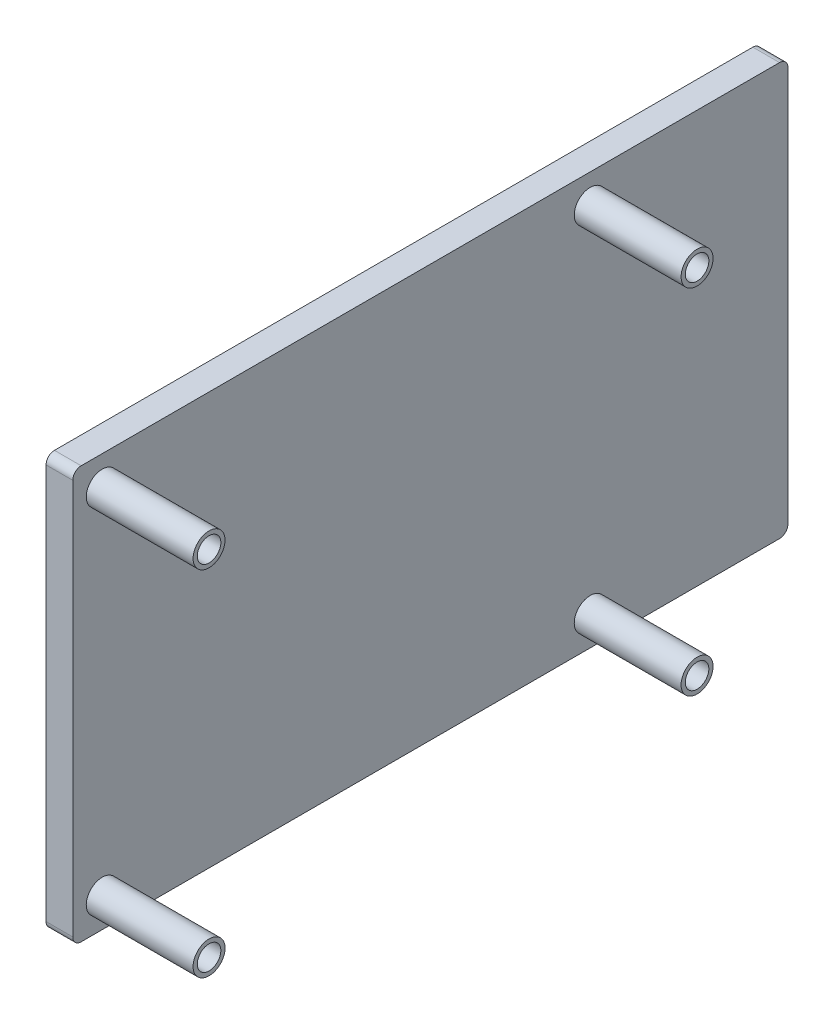
ISO-10303-21;
HEADER;
FILE_DESCRIPTION(('STEP AP214'),'2;1');
FILE_NAME('part.step','',(''),(''),'','','');
FILE_SCHEMA(('AUTOMOTIVE_DESIGN { 1 0 10303 214 1 1 1 1 }'));
ENDSEC;
DATA;
#1=APPLICATION_CONTEXT('core data for automotive mechanical design processes');
#2=APPLICATION_PROTOCOL_DEFINITION('international standard','automotive_design',2000,#1);
#3=PRODUCT_CONTEXT('',#1,'mechanical');
#4=PRODUCT('Part','Part','',(#3));
#5=PRODUCT_RELATED_PRODUCT_CATEGORY('part','',(#4));
#6=PRODUCT_DEFINITION_FORMATION('','',#4);
#7=PRODUCT_DEFINITION_CONTEXT('part definition',#1,'design');
#8=PRODUCT_DEFINITION('design','',#6,#7);
#9=PRODUCT_DEFINITION_SHAPE('','',#8);
#10=(LENGTH_UNIT() NAMED_UNIT(*) SI_UNIT(.MILLI.,.METRE.));
#11=(NAMED_UNIT(*) PLANE_ANGLE_UNIT() SI_UNIT($,.RADIAN.));
#12=(NAMED_UNIT(*) SI_UNIT($,.STERADIAN.) SOLID_ANGLE_UNIT());
#13=UNCERTAINTY_MEASURE_WITH_UNIT(LENGTH_MEASURE(1.E-05),#10,'distance_accuracy_value','');
#14=(GEOMETRIC_REPRESENTATION_CONTEXT(3) GLOBAL_UNCERTAINTY_ASSIGNED_CONTEXT((#13)) GLOBAL_UNIT_ASSIGNED_CONTEXT((#10,
#11,#12)) REPRESENTATION_CONTEXT('',''));
#15=CARTESIAN_POINT('',(0.,0.,0.));
#16=DIRECTION('',(0.,0.,1.));
#17=DIRECTION('',(1.,0.,0.));
#18=AXIS2_PLACEMENT_3D('',#15,#16,#17);
#19=CARTESIAN_POINT('',(3.175,15.3017543859649,54.3298245614035));
#20=DIRECTION('',(0.,0.,-1.));
#21=DIRECTION('',(-1.,0.,0.));
#22=AXIS2_PLACEMENT_3D('',#19,#20,#21);
#23=PLANE('',#22);
#24=DIRECTION('',(0.,-1.,0.));
#25=VECTOR('',#24,1.);
#26=CARTESIAN_POINT('',(3.175,15.3017543859649,54.3298245614035));
#27=LINE('',#26,#25);
#28=CARTESIAN_POINT('',(3.175,14.3017543859649,54.3298245614035));
#29=VERTEX_POINT('',#28);
#30=CARTESIAN_POINT('',(3.175,-32.6982456140351,54.3298245614035));
#31=VERTEX_POINT('',#30);
#32=EDGE_CURVE('E119',#29,#31,#27,.T.);
#33=ORIENTED_EDGE('',*,*,#32,.F.);
#34=DIRECTION('',(-1.,0.,0.));
#35=VECTOR('',#34,1.);
#36=CARTESIAN_POINT('',(3.175,14.3017543859649,54.3298245614035));
#37=LINE('',#36,#35);
#38=CARTESIAN_POINT('',(0.,14.3017543859649,54.3298245614035));
#39=VERTEX_POINT('',#38);
#40=EDGE_CURVE('E104',#29,#39,#37,.T.);
#41=ORIENTED_EDGE('',*,*,#40,.T.);
#42=DIRECTION('',(0.,-1.,0.));
#43=VECTOR('',#42,1.);
#44=CARTESIAN_POINT('',(0.,15.3017543859649,54.3298245614035));
#45=LINE('',#44,#43);
#46=CARTESIAN_POINT('',(0.,-32.6982456140351,54.3298245614035));
#47=VERTEX_POINT('',#46);
#48=EDGE_CURVE('E116',#39,#47,#45,.T.);
#49=ORIENTED_EDGE('',*,*,#48,.T.);
#50=DIRECTION('',(-1.,0.,0.));
#51=VECTOR('',#50,1.);
#52=CARTESIAN_POINT('',(3.175,-32.6982456140351,54.3298245614035));
#53=LINE('',#52,#51);
#54=EDGE_CURVE('E121',#47,#31,#53,.F.);
#55=ORIENTED_EDGE('',*,*,#54,.T.);
#56=EDGE_LOOP('',(#33,#41,#49,#55));
#57=FACE_BOUND('',#56,.T.);
#58=ADVANCED_FACE('F34',(#57),#23,.F.);
#59=CARTESIAN_POINT('',(3.175,-33.6982456140351,54.3298245614035));
#60=DIRECTION('',(0.,1.,0.));
#61=DIRECTION('',(0.,0.,1.));
#62=AXIS2_PLACEMENT_3D('',#59,#60,#61);
#63=PLANE('',#62);
#64=DIRECTION('',(0.,0.,-1.));
#65=VECTOR('',#64,1.);
#66=CARTESIAN_POINT('',(0.,-33.6982456140351,54.3298245614035));
#67=LINE('',#66,#65);
#68=CARTESIAN_POINT('',(0.,-33.6982456140351,53.3298245614035));
#69=VERTEX_POINT('',#68);
#70=CARTESIAN_POINT('',(0.,-33.6982456140351,-29.6701754385965));
#71=VERTEX_POINT('',#70);
#72=EDGE_CURVE('E125',#69,#71,#67,.T.);
#73=ORIENTED_EDGE('',*,*,#72,.T.);
#74=DIRECTION('',(-1.,0.,0.));
#75=VECTOR('',#74,1.);
#76=CARTESIAN_POINT('',(3.175,-33.6982456140351,-29.6701754385965));
#77=LINE('',#76,#75);
#78=CARTESIAN_POINT('',(3.175,-33.6982456140351,-29.6701754385965));
#79=VERTEX_POINT('',#78);
#80=EDGE_CURVE('E11',#71,#79,#77,.F.);
#81=ORIENTED_EDGE('',*,*,#80,.T.);
#82=DIRECTION('',(0.,0.,-1.));
#83=VECTOR('',#82,1.);
#84=CARTESIAN_POINT('',(3.175,-33.6982456140351,54.3298245614035));
#85=LINE('',#84,#83);
#86=CARTESIAN_POINT('',(3.175,-33.6982456140351,53.3298245614035));
#87=VERTEX_POINT('',#86);
#88=EDGE_CURVE('E177',#87,#79,#85,.T.);
#89=ORIENTED_EDGE('',*,*,#88,.F.);
#90=DIRECTION('',(-1.,0.,0.));
#91=VECTOR('',#90,1.);
#92=CARTESIAN_POINT('',(3.175,-33.6982456140351,53.3298245614035));
#93=LINE('',#92,#91);
#94=EDGE_CURVE('E42',#87,#69,#93,.T.);
#95=ORIENTED_EDGE('',*,*,#94,.T.);
#96=EDGE_LOOP('',(#73,#81,#89,#95));
#97=FACE_BOUND('',#96,.T.);
#98=ADVANCED_FACE('F175',(#97),#63,.F.);
#99=CARTESIAN_POINT('',(3.175,15.3017543859649,-30.6701754385965));
#100=DIRECTION('',(0.,0.,1.));
#101=DIRECTION('',(1.,0.,0.));
#102=AXIS2_PLACEMENT_3D('',#99,#100,#101);
#103=PLANE('',#102);
#104=DIRECTION('',(0.,1.,0.));
#105=VECTOR('',#104,1.);
#106=CARTESIAN_POINT('',(0.,15.3017543859649,-30.6701754385965));
#107=LINE('',#106,#105);
#108=CARTESIAN_POINT('',(0.,-32.6982456140351,-30.6701754385965));
#109=VERTEX_POINT('',#108);
#110=CARTESIAN_POINT('',(0.,14.3017543859649,-30.6701754385965));
#111=VERTEX_POINT('',#110);
#112=EDGE_CURVE('E129',#109,#111,#107,.T.);
#113=ORIENTED_EDGE('',*,*,#112,.T.);
#114=DIRECTION('',(-1.,0.,0.));
#115=VECTOR('',#114,1.);
#116=CARTESIAN_POINT('',(3.175,14.3017543859649,-30.6701754385965));
#117=LINE('',#116,#115);
#118=CARTESIAN_POINT('',(3.175,14.3017543859649,-30.6701754385965));
#119=VERTEX_POINT('',#118);
#120=EDGE_CURVE('E49',#111,#119,#117,.F.);
#121=ORIENTED_EDGE('',*,*,#120,.T.);
#122=DIRECTION('',(0.,1.,0.));
#123=VECTOR('',#122,1.);
#124=CARTESIAN_POINT('',(3.175,15.3017543859649,-30.6701754385965));
#125=LINE('',#124,#123);
#126=CARTESIAN_POINT('',(3.175,-32.6982456140351,-30.6701754385965));
#127=VERTEX_POINT('',#126);
#128=EDGE_CURVE('E185',#127,#119,#125,.T.);
#129=ORIENTED_EDGE('',*,*,#128,.F.);
#130=DIRECTION('',(-1.,0.,0.));
#131=VECTOR('',#130,1.);
#132=CARTESIAN_POINT('',(3.175,-32.6982456140351,-30.6701754385965));
#133=LINE('',#132,#131);
#134=EDGE_CURVE('E168',#127,#109,#133,.T.);
#135=ORIENTED_EDGE('',*,*,#134,.T.);
#136=EDGE_LOOP('',(#113,#121,#129,#135));
#137=FACE_BOUND('',#136,.T.);
#138=ADVANCED_FACE('F184',(#137),#103,.F.);
#139=CARTESIAN_POINT('',(3.175,15.3017543859649,54.3298245614035));
#140=DIRECTION('',(0.,-1.,0.));
#141=DIRECTION('',(0.,0.,-1.));
#142=AXIS2_PLACEMENT_3D('',#139,#140,#141);
#143=PLANE('',#142);
#144=DIRECTION('',(0.,0.,1.));
#145=VECTOR('',#144,1.);
#146=CARTESIAN_POINT('',(0.,15.3017543859649,54.3298245614035));
#147=LINE('',#146,#145);
#148=CARTESIAN_POINT('',(0.,15.3017543859649,-29.6701754385965));
#149=VERTEX_POINT('',#148);
#150=CARTESIAN_POINT('',(0.,15.3017543859649,53.3298245614035));
#151=VERTEX_POINT('',#150);
#152=EDGE_CURVE('E139',#149,#151,#147,.T.);
#153=ORIENTED_EDGE('',*,*,#152,.T.);
#154=DIRECTION('',(-1.,0.,0.));
#155=VECTOR('',#154,1.);
#156=CARTESIAN_POINT('',(3.175,15.3017543859649,53.3298245614035));
#157=LINE('',#156,#155);
#158=CARTESIAN_POINT('',(3.175,15.3017543859649,53.3298245614035));
#159=VERTEX_POINT('',#158);
#160=EDGE_CURVE('E105',#151,#159,#157,.F.);
#161=ORIENTED_EDGE('',*,*,#160,.T.);
#162=DIRECTION('',(0.,0.,1.));
#163=VECTOR('',#162,1.);
#164=CARTESIAN_POINT('',(3.175,15.3017543859649,54.3298245614035));
#165=LINE('',#164,#163);
#166=CARTESIAN_POINT('',(3.175,15.3017543859649,-29.6701754385965));
#167=VERTEX_POINT('',#166);
#168=EDGE_CURVE('E135',#167,#159,#165,.T.);
#169=ORIENTED_EDGE('',*,*,#168,.F.);
#170=DIRECTION('',(-1.,0.,0.));
#171=VECTOR('',#170,1.);
#172=CARTESIAN_POINT('',(3.175,15.3017543859649,-29.6701754385965));
#173=LINE('',#172,#171);
#174=EDGE_CURVE('E110',#167,#149,#173,.T.);
#175=ORIENTED_EDGE('',*,*,#174,.T.);
#176=EDGE_LOOP('',(#153,#161,#169,#175));
#177=FACE_BOUND('',#176,.T.);
#178=ADVANCED_FACE('F268',(#177),#143,.F.);
#179=CARTESIAN_POINT('',(3.175,0.,0.));
#180=DIRECTION('',(1.,0.,0.));
#181=DIRECTION('',(0.,0.,-1.));
#182=AXIS2_PLACEMENT_3D('',#179,#180,#181);
#183=PLANE('',#182);
#184=CARTESIAN_POINT('',(3.175,-30.1982456140351,50.8298245614035));
#185=DIRECTION('',(1.,0.,0.));
#186=DIRECTION('',(0.,0.,1.));
#187=AXIS2_PLACEMENT_3D('',#184,#185,#186);
#188=CIRCLE('',#187,1.9);
#189=CARTESIAN_POINT('',(3.175,-30.1982456140351,52.7298245614035));
#190=VERTEX_POINT('',#189);
#191=EDGE_CURVE('E215',#190,#190,#188,.T.);
#192=ORIENTED_EDGE('',*,*,#191,.F.);
#193=EDGE_LOOP('',(#192));
#194=FACE_BOUND('',#193,.T.);
#195=CARTESIAN_POINT('',(3.175,-30.1982456140351,-7.1701754385965));
#196=DIRECTION('',(1.,0.,0.));
#197=DIRECTION('',(0.,0.,1.));
#198=AXIS2_PLACEMENT_3D('',#195,#196,#197);
#199=CIRCLE('',#198,1.9);
#200=CARTESIAN_POINT('',(3.175,-30.1982456140351,-5.2701754385965));
#201=VERTEX_POINT('',#200);
#202=EDGE_CURVE('E206',#201,#201,#199,.T.);
#203=ORIENTED_EDGE('',*,*,#202,.F.);
#204=EDGE_LOOP('',(#203));
#205=FACE_BOUND('',#204,.T.);
#206=CARTESIAN_POINT('',(3.175,11.8017543859649,-7.1701754385965));
#207=DIRECTION('',(1.,0.,0.));
#208=DIRECTION('',(0.,0.,-1.));
#209=AXIS2_PLACEMENT_3D('',#206,#207,#208);
#210=CIRCLE('',#209,1.9);
#211=CARTESIAN_POINT('',(3.175,11.8017543859649,-9.0701754385965));
#212=VERTEX_POINT('',#211);
#213=EDGE_CURVE('E197',#212,#212,#210,.T.);
#214=ORIENTED_EDGE('',*,*,#213,.F.);
#215=EDGE_LOOP('',(#214));
#216=FACE_BOUND('',#215,.T.);
#217=CARTESIAN_POINT('',(3.175,11.8017543859649,50.8298245614035));
#218=DIRECTION('',(1.,0.,0.));
#219=DIRECTION('',(0.,0.,-1.));
#220=AXIS2_PLACEMENT_3D('',#217,#218,#219);
#221=CIRCLE('',#220,1.9);
#222=CARTESIAN_POINT('',(3.175,11.8017543859649,48.9298245614035));
#223=VERTEX_POINT('',#222);
#224=EDGE_CURVE('E132',#223,#223,#221,.T.);
#225=ORIENTED_EDGE('',*,*,#224,.F.);
#226=EDGE_LOOP('',(#225));
#227=FACE_BOUND('',#226,.T.);
#228=ORIENTED_EDGE('',*,*,#168,.T.);
#229=CARTESIAN_POINT('',(3.175,14.3017543859649,53.3298245614035));
#230=DIRECTION('',(1.,0.,0.));
#231=DIRECTION('',(0.,0.,-1.));
#232=AXIS2_PLACEMENT_3D('',#229,#230,#231);
#233=CIRCLE('',#232,1.);
#234=EDGE_CURVE('E166',#159,#29,#233,.T.);
#235=ORIENTED_EDGE('',*,*,#234,.T.);
#236=ORIENTED_EDGE('',*,*,#32,.T.);
#237=CARTESIAN_POINT('',(3.175,-32.6982456140351,53.3298245614035));
#238=DIRECTION('',(1.,0.,0.));
#239=DIRECTION('',(0.,0.,-1.));
#240=AXIS2_PLACEMENT_3D('',#237,#238,#239);
#241=CIRCLE('',#240,1.);
#242=EDGE_CURVE('E161',#31,#87,#241,.T.);
#243=ORIENTED_EDGE('',*,*,#242,.T.);
#244=ORIENTED_EDGE('',*,*,#88,.T.);
#245=CARTESIAN_POINT('',(3.175,-32.6982456140351,-29.6701754385965));
#246=DIRECTION('',(1.,0.,0.));
#247=DIRECTION('',(0.,0.,-1.));
#248=AXIS2_PLACEMENT_3D('',#245,#246,#247);
#249=CIRCLE('',#248,1.);
#250=EDGE_CURVE('E56',#79,#127,#249,.T.);
#251=ORIENTED_EDGE('',*,*,#250,.T.);
#252=ORIENTED_EDGE('',*,*,#128,.T.);
#253=CARTESIAN_POINT('',(3.175,14.3017543859649,-29.6701754385965));
#254=DIRECTION('',(1.,0.,0.));
#255=DIRECTION('',(0.,0.,-1.));
#256=AXIS2_PLACEMENT_3D('',#253,#254,#255);
#257=CIRCLE('',#256,1.);
#258=EDGE_CURVE('E164',#119,#167,#257,.T.);
#259=ORIENTED_EDGE('',*,*,#258,.T.);
#260=EDGE_LOOP('',(#228,#235,#236,#243,#244,#251,#252,#259));
#261=FACE_BOUND('',#260,.T.);
#262=ADVANCED_FACE('F264',(#194,#205,#216,#227,#261),#183,.T.);
#263=CARTESIAN_POINT('',(0.,0.,0.));
#264=DIRECTION('',(1.,0.,0.));
#265=DIRECTION('',(0.,0.,-1.));
#266=AXIS2_PLACEMENT_3D('',#263,#264,#265);
#267=PLANE('',#266);
#268=ORIENTED_EDGE('',*,*,#48,.F.);
#269=CARTESIAN_POINT('',(0.,14.3017543859649,53.3298245614035));
#270=DIRECTION('',(1.,0.,0.));
#271=DIRECTION('',(0.,0.,-1.));
#272=AXIS2_PLACEMENT_3D('',#269,#270,#271);
#273=CIRCLE('',#272,1.);
#274=EDGE_CURVE('E100',#39,#151,#273,.F.);
#275=ORIENTED_EDGE('',*,*,#274,.T.);
#276=ORIENTED_EDGE('',*,*,#152,.F.);
#277=CARTESIAN_POINT('',(0.,14.3017543859649,-29.6701754385965));
#278=DIRECTION('',(1.,0.,0.));
#279=DIRECTION('',(0.,0.,-1.));
#280=AXIS2_PLACEMENT_3D('',#277,#278,#279);
#281=CIRCLE('',#280,1.);
#282=EDGE_CURVE('E111',#149,#111,#281,.F.);
#283=ORIENTED_EDGE('',*,*,#282,.T.);
#284=ORIENTED_EDGE('',*,*,#112,.F.);
#285=CARTESIAN_POINT('',(0.,-32.6982456140351,-29.6701754385965));
#286=DIRECTION('',(1.,0.,0.));
#287=DIRECTION('',(0.,0.,-1.));
#288=AXIS2_PLACEMENT_3D('',#285,#286,#287);
#289=CIRCLE('',#288,1.);
#290=EDGE_CURVE('E155',#109,#71,#289,.F.);
#291=ORIENTED_EDGE('',*,*,#290,.T.);
#292=ORIENTED_EDGE('',*,*,#72,.F.);
#293=CARTESIAN_POINT('',(0.,-32.6982456140351,53.3298245614035));
#294=DIRECTION('',(1.,0.,0.));
#295=DIRECTION('',(0.,0.,-1.));
#296=AXIS2_PLACEMENT_3D('',#293,#294,#295);
#297=CIRCLE('',#296,1.);
#298=EDGE_CURVE('E120',#69,#47,#297,.F.);
#299=ORIENTED_EDGE('',*,*,#298,.T.);
#300=EDGE_LOOP('',(#268,#275,#276,#283,#284,#291,#292,#299));
#301=FACE_BOUND('',#300,.T.);
#302=ADVANCED_FACE('F123',(#301),#267,.F.);
#303=CARTESIAN_POINT('',(15.875,11.8017543859649,50.8298245614035));
#304=DIRECTION('',(1.,0.,0.));
#305=DIRECTION('',(0.,0.,-1.));
#306=AXIS2_PLACEMENT_3D('',#303,#304,#305);
#307=PLANE('',#306);
#308=CARTESIAN_POINT('',(15.875,11.8017543859649,50.8298245614035));
#309=DIRECTION('',(1.,0.,0.));
#310=DIRECTION('',(0.,0.,-1.));
#311=AXIS2_PLACEMENT_3D('',#308,#309,#310);
#312=CIRCLE('',#311,1.9);
#313=CARTESIAN_POINT('',(15.875,11.8017543859649,48.9298245614035));
#314=VERTEX_POINT('',#313);
#315=EDGE_CURVE('E126',#314,#314,#312,.T.);
#316=ORIENTED_EDGE('',*,*,#315,.T.);
#317=EDGE_LOOP('',(#316));
#318=FACE_BOUND('',#317,.T.);
#319=CARTESIAN_POINT('',(15.875,11.8017543859649,50.8298245614035));
#320=DIRECTION('',(1.,0.,0.));
#321=DIRECTION('',(0.,0.,-1.));
#322=AXIS2_PLACEMENT_3D('',#319,#320,#321);
#323=CIRCLE('',#322,1.4);
#324=CARTESIAN_POINT('',(15.875,11.8017543859649,49.4298245614035));
#325=VERTEX_POINT('',#324);
#326=EDGE_CURVE('E192',#325,#325,#323,.T.);
#327=ORIENTED_EDGE('',*,*,#326,.F.);
#328=EDGE_LOOP('',(#327));
#329=FACE_BOUND('',#328,.T.);
#330=ADVANCED_FACE('F279',(#318,#329),#307,.T.);
#331=CARTESIAN_POINT('',(15.875,11.8017543859649,50.8298245614035));
#332=DIRECTION('',(-1.,0.,0.));
#333=DIRECTION('',(0.,0.,1.));
#334=AXIS2_PLACEMENT_3D('',#331,#332,#333);
#335=CYLINDRICAL_SURFACE('',#334,1.9);
#336=ORIENTED_EDGE('',*,*,#315,.F.);
#337=EDGE_LOOP('',(#336));
#338=FACE_BOUND('',#337,.T.);
#339=ORIENTED_EDGE('',*,*,#224,.T.);
#340=EDGE_LOOP('',(#339));
#341=FACE_BOUND('',#340,.T.);
#342=ADVANCED_FACE('F281',(#338,#341),#335,.T.);
#343=CARTESIAN_POINT('',(15.875,11.8017543859649,50.8298245614035));
#344=DIRECTION('',(-1.,0.,0.));
#345=DIRECTION('',(0.,0.,1.));
#346=AXIS2_PLACEMENT_3D('',#343,#344,#345);
#347=CYLINDRICAL_SURFACE('',#346,1.4);
#348=ORIENTED_EDGE('',*,*,#326,.T.);
#349=EDGE_LOOP('',(#348));
#350=FACE_BOUND('',#349,.T.);
#351=CARTESIAN_POINT('',(3.175,11.8017543859649,50.8298245614035));
#352=DIRECTION('',(1.,0.,0.));
#353=DIRECTION('',(0.,0.,-1.));
#354=AXIS2_PLACEMENT_3D('',#351,#352,#353);
#355=CIRCLE('',#354,1.4);
#356=CARTESIAN_POINT('',(3.175,11.8017543859649,49.4298245614035));
#357=VERTEX_POINT('',#356);
#358=EDGE_CURVE('E141',#357,#357,#355,.F.);
#359=ORIENTED_EDGE('',*,*,#358,.T.);
#360=EDGE_LOOP('',(#359));
#361=FACE_BOUND('',#360,.T.);
#362=ADVANCED_FACE('F284',(#350,#361),#347,.F.);
#363=ORIENTED_EDGE('',*,*,#358,.F.);
#364=EDGE_LOOP('',(#363));
#365=FACE_BOUND('',#364,.T.);
#366=ADVANCED_FACE('F276',(#365),#183,.T.);
#367=CARTESIAN_POINT('',(15.875,11.8017543859649,-7.1701754385965));
#368=DIRECTION('',(1.,0.,0.));
#369=DIRECTION('',(0.,0.,-1.));
#370=AXIS2_PLACEMENT_3D('',#367,#368,#369);
#371=PLANE('',#370);
#372=CARTESIAN_POINT('',(15.875,11.8017543859649,-7.1701754385965));
#373=DIRECTION('',(1.,0.,0.));
#374=DIRECTION('',(0.,0.,-1.));
#375=AXIS2_PLACEMENT_3D('',#372,#373,#374);
#376=CIRCLE('',#375,1.9);
#377=CARTESIAN_POINT('',(15.875,11.8017543859649,-9.0701754385965));
#378=VERTEX_POINT('',#377);
#379=EDGE_CURVE('E196',#378,#378,#376,.T.);
#380=ORIENTED_EDGE('',*,*,#379,.T.);
#381=EDGE_LOOP('',(#380));
#382=FACE_BOUND('',#381,.T.);
#383=CARTESIAN_POINT('',(15.875,11.8017543859649,-7.1701754385965));
#384=DIRECTION('',(1.,0.,0.));
#385=DIRECTION('',(0.,0.,-1.));
#386=AXIS2_PLACEMENT_3D('',#383,#384,#385);
#387=CIRCLE('',#386,1.4);
#388=CARTESIAN_POINT('',(15.875,11.8017543859649,-8.5701754385965));
#389=VERTEX_POINT('',#388);
#390=EDGE_CURVE('E200',#389,#389,#387,.T.);
#391=ORIENTED_EDGE('',*,*,#390,.F.);
#392=EDGE_LOOP('',(#391));
#393=FACE_BOUND('',#392,.T.);
#394=ADVANCED_FACE('F296',(#382,#393),#371,.T.);
#395=CARTESIAN_POINT('',(15.875,11.8017543859649,-7.1701754385965));
#396=DIRECTION('',(-1.,0.,0.));
#397=DIRECTION('',(0.,0.,1.));
#398=AXIS2_PLACEMENT_3D('',#395,#396,#397);
#399=CYLINDRICAL_SURFACE('',#398,1.9);
#400=ORIENTED_EDGE('',*,*,#379,.F.);
#401=EDGE_LOOP('',(#400));
#402=FACE_BOUND('',#401,.T.);
#403=ORIENTED_EDGE('',*,*,#213,.T.);
#404=EDGE_LOOP('',(#403));
#405=FACE_BOUND('',#404,.T.);
#406=ADVANCED_FACE('F292',(#402,#405),#399,.T.);
#407=CARTESIAN_POINT('',(15.875,11.8017543859649,-7.1701754385965));
#408=DIRECTION('',(-1.,0.,0.));
#409=DIRECTION('',(0.,0.,1.));
#410=AXIS2_PLACEMENT_3D('',#407,#408,#409);
#411=CYLINDRICAL_SURFACE('',#410,1.4);
#412=ORIENTED_EDGE('',*,*,#390,.T.);
#413=EDGE_LOOP('',(#412));
#414=FACE_BOUND('',#413,.T.);
#415=CARTESIAN_POINT('',(3.175,11.8017543859649,-7.1701754385965));
#416=DIRECTION('',(1.,0.,0.));
#417=DIRECTION('',(0.,0.,-1.));
#418=AXIS2_PLACEMENT_3D('',#415,#416,#417);
#419=CIRCLE('',#418,1.4);
#420=CARTESIAN_POINT('',(3.175,11.8017543859649,-8.5701754385965));
#421=VERTEX_POINT('',#420);
#422=EDGE_CURVE('E144',#421,#421,#419,.F.);
#423=ORIENTED_EDGE('',*,*,#422,.T.);
#424=EDGE_LOOP('',(#423));
#425=FACE_BOUND('',#424,.T.);
#426=ADVANCED_FACE('F295',(#414,#425),#411,.F.);
#427=ORIENTED_EDGE('',*,*,#422,.F.);
#428=EDGE_LOOP('',(#427));
#429=FACE_BOUND('',#428,.T.);
#430=ADVANCED_FACE('F242',(#429),#183,.T.);
#431=CARTESIAN_POINT('',(15.875,-30.1982456140351,-7.1701754385965));
#432=DIRECTION('',(-1.,0.,0.));
#433=DIRECTION('',(0.,0.,1.));
#434=AXIS2_PLACEMENT_3D('',#431,#432,#433);
#435=PLANE('',#434);
#436=CARTESIAN_POINT('',(15.875,-30.1982456140351,-7.1701754385965));
#437=DIRECTION('',(1.,0.,0.));
#438=DIRECTION('',(0.,0.,1.));
#439=AXIS2_PLACEMENT_3D('',#436,#437,#438);
#440=CIRCLE('',#439,1.9);
#441=CARTESIAN_POINT('',(15.875,-30.1982456140351,-5.2701754385965));
#442=VERTEX_POINT('',#441);
#443=EDGE_CURVE('E205',#442,#442,#440,.T.);
#444=ORIENTED_EDGE('',*,*,#443,.T.);
#445=EDGE_LOOP('',(#444));
#446=FACE_BOUND('',#445,.T.);
#447=CARTESIAN_POINT('',(15.875,-30.1982456140351,-7.1701754385965));
#448=DIRECTION('',(1.,0.,0.));
#449=DIRECTION('',(0.,0.,1.));
#450=AXIS2_PLACEMENT_3D('',#447,#448,#449);
#451=CIRCLE('',#450,1.4);
#452=CARTESIAN_POINT('',(15.875,-30.1982456140351,-5.7701754385965));
#453=VERTEX_POINT('',#452);
#454=EDGE_CURVE('E209',#453,#453,#451,.T.);
#455=ORIENTED_EDGE('',*,*,#454,.F.);
#456=EDGE_LOOP('',(#455));
#457=FACE_BOUND('',#456,.T.);
#458=ADVANCED_FACE('F307',(#446,#457),#435,.F.);
#459=CARTESIAN_POINT('',(15.875,-30.1982456140351,-7.1701754385965));
#460=DIRECTION('',(-1.,0.,0.));
#461=DIRECTION('',(0.,0.,1.));
#462=AXIS2_PLACEMENT_3D('',#459,#460,#461);
#463=CYLINDRICAL_SURFACE('',#462,1.9);
#464=ORIENTED_EDGE('',*,*,#443,.F.);
#465=EDGE_LOOP('',(#464));
#466=FACE_BOUND('',#465,.T.);
#467=ORIENTED_EDGE('',*,*,#202,.T.);
#468=EDGE_LOOP('',(#467));
#469=FACE_BOUND('',#468,.T.);
#470=ADVANCED_FACE('F304',(#466,#469),#463,.T.);
#471=CARTESIAN_POINT('',(15.875,-30.1982456140351,-7.1701754385965));
#472=DIRECTION('',(-1.,0.,0.));
#473=DIRECTION('',(0.,0.,1.));
#474=AXIS2_PLACEMENT_3D('',#471,#472,#473);
#475=CYLINDRICAL_SURFACE('',#474,1.4);
#476=ORIENTED_EDGE('',*,*,#454,.T.);
#477=EDGE_LOOP('',(#476));
#478=FACE_BOUND('',#477,.T.);
#479=CARTESIAN_POINT('',(3.175,-30.1982456140351,-7.1701754385965));
#480=DIRECTION('',(1.,0.,0.));
#481=DIRECTION('',(0.,0.,-1.));
#482=AXIS2_PLACEMENT_3D('',#479,#480,#481);
#483=CIRCLE('',#482,1.4);
#484=CARTESIAN_POINT('',(3.175,-30.1982456140351,-8.5701754385965));
#485=VERTEX_POINT('',#484);
#486=EDGE_CURVE('E147',#485,#485,#483,.F.);
#487=ORIENTED_EDGE('',*,*,#486,.T.);
#488=EDGE_LOOP('',(#487));
#489=FACE_BOUND('',#488,.T.);
#490=ADVANCED_FACE('F239',(#478,#489),#475,.F.);
#491=ORIENTED_EDGE('',*,*,#486,.F.);
#492=EDGE_LOOP('',(#491));
#493=FACE_BOUND('',#492,.T.);
#494=ADVANCED_FACE('F230',(#493),#183,.T.);
#495=CARTESIAN_POINT('',(15.875,-30.1982456140351,50.8298245614035));
#496=DIRECTION('',(-1.,0.,0.));
#497=DIRECTION('',(0.,0.,1.));
#498=AXIS2_PLACEMENT_3D('',#495,#496,#497);
#499=PLANE('',#498);
#500=CARTESIAN_POINT('',(15.875,-30.1982456140351,50.8298245614035));
#501=DIRECTION('',(1.,0.,0.));
#502=DIRECTION('',(0.,0.,1.));
#503=AXIS2_PLACEMENT_3D('',#500,#501,#502);
#504=CIRCLE('',#503,1.9);
#505=CARTESIAN_POINT('',(15.875,-30.1982456140351,52.7298245614035));
#506=VERTEX_POINT('',#505);
#507=EDGE_CURVE('E214',#506,#506,#504,.T.);
#508=ORIENTED_EDGE('',*,*,#507,.T.);
#509=EDGE_LOOP('',(#508));
#510=FACE_BOUND('',#509,.T.);
#511=CARTESIAN_POINT('',(15.875,-30.1982456140351,50.8298245614035));
#512=DIRECTION('',(1.,0.,0.));
#513=DIRECTION('',(0.,0.,1.));
#514=AXIS2_PLACEMENT_3D('',#511,#512,#513);
#515=CIRCLE('',#514,1.4);
#516=CARTESIAN_POINT('',(15.875,-30.1982456140351,52.2298245614035));
#517=VERTEX_POINT('',#516);
#518=EDGE_CURVE('E218',#517,#517,#515,.T.);
#519=ORIENTED_EDGE('',*,*,#518,.F.);
#520=EDGE_LOOP('',(#519));
#521=FACE_BOUND('',#520,.T.);
#522=ADVANCED_FACE('F227',(#510,#521),#499,.F.);
#523=CARTESIAN_POINT('',(15.875,-30.1982456140351,50.8298245614035));
#524=DIRECTION('',(-1.,0.,0.));
#525=DIRECTION('',(0.,0.,1.));
#526=AXIS2_PLACEMENT_3D('',#523,#524,#525);
#527=CYLINDRICAL_SURFACE('',#526,1.9);
#528=ORIENTED_EDGE('',*,*,#507,.F.);
#529=EDGE_LOOP('',(#528));
#530=FACE_BOUND('',#529,.T.);
#531=ORIENTED_EDGE('',*,*,#191,.T.);
#532=EDGE_LOOP('',(#531));
#533=FACE_BOUND('',#532,.T.);
#534=ADVANCED_FACE('F229',(#530,#533),#527,.T.);
#535=CARTESIAN_POINT('',(15.875,-30.1982456140351,50.8298245614035));
#536=DIRECTION('',(-1.,0.,0.));
#537=DIRECTION('',(0.,0.,1.));
#538=AXIS2_PLACEMENT_3D('',#535,#536,#537);
#539=CYLINDRICAL_SURFACE('',#538,1.4);
#540=ORIENTED_EDGE('',*,*,#518,.T.);
#541=EDGE_LOOP('',(#540));
#542=FACE_BOUND('',#541,.T.);
#543=CARTESIAN_POINT('',(3.175,-30.1982456140351,50.8298245614035));
#544=DIRECTION('',(1.,0.,0.));
#545=DIRECTION('',(0.,0.,-1.));
#546=AXIS2_PLACEMENT_3D('',#543,#544,#545);
#547=CIRCLE('',#546,1.4);
#548=CARTESIAN_POINT('',(3.175,-30.1982456140351,49.4298245614035));
#549=VERTEX_POINT('',#548);
#550=EDGE_CURVE('E150',#549,#549,#547,.F.);
#551=ORIENTED_EDGE('',*,*,#550,.T.);
#552=EDGE_LOOP('',(#551));
#553=FACE_BOUND('',#552,.T.);
#554=ADVANCED_FACE('F224',(#542,#553),#539,.F.);
#555=ORIENTED_EDGE('',*,*,#550,.F.);
#556=EDGE_LOOP('',(#555));
#557=FACE_BOUND('',#556,.T.);
#558=ADVANCED_FACE('F243',(#557),#183,.T.);
#559=CARTESIAN_POINT('',(3.175,14.3017543859649,53.3298245614035));
#560=DIRECTION('',(-1.,0.,0.));
#561=DIRECTION('',(0.,0.,1.));
#562=AXIS2_PLACEMENT_3D('',#559,#560,#561);
#563=CYLINDRICAL_SURFACE('',#562,1.);
#564=ORIENTED_EDGE('',*,*,#234,.F.);
#565=ORIENTED_EDGE('',*,*,#160,.F.);
#566=ORIENTED_EDGE('',*,*,#274,.F.);
#567=ORIENTED_EDGE('',*,*,#40,.F.);
#568=EDGE_LOOP('',(#564,#565,#566,#567));
#569=FACE_BOUND('',#568,.T.);
#570=ADVANCED_FACE('F103',(#569),#563,.T.);
#571=CARTESIAN_POINT('',(3.175,14.3017543859649,-29.6701754385965));
#572=DIRECTION('',(-1.,0.,0.));
#573=DIRECTION('',(0.,0.,1.));
#574=AXIS2_PLACEMENT_3D('',#571,#572,#573);
#575=CYLINDRICAL_SURFACE('',#574,1.);
#576=ORIENTED_EDGE('',*,*,#258,.F.);
#577=ORIENTED_EDGE('',*,*,#120,.F.);
#578=ORIENTED_EDGE('',*,*,#282,.F.);
#579=ORIENTED_EDGE('',*,*,#174,.F.);
#580=EDGE_LOOP('',(#576,#577,#578,#579));
#581=FACE_BOUND('',#580,.T.);
#582=ADVANCED_FACE('F255',(#581),#575,.T.);
#583=CARTESIAN_POINT('',(3.175,-32.6982456140351,-29.6701754385965));
#584=DIRECTION('',(-1.,0.,0.));
#585=DIRECTION('',(0.,0.,1.));
#586=AXIS2_PLACEMENT_3D('',#583,#584,#585);
#587=CYLINDRICAL_SURFACE('',#586,1.);
#588=ORIENTED_EDGE('',*,*,#250,.F.);
#589=ORIENTED_EDGE('',*,*,#80,.F.);
#590=ORIENTED_EDGE('',*,*,#290,.F.);
#591=ORIENTED_EDGE('',*,*,#134,.F.);
#592=EDGE_LOOP('',(#588,#589,#590,#591));
#593=FACE_BOUND('',#592,.T.);
#594=ADVANCED_FACE('F183',(#593),#587,.T.);
#595=CARTESIAN_POINT('',(3.175,-32.6982456140351,53.3298245614035));
#596=DIRECTION('',(-1.,0.,0.));
#597=DIRECTION('',(0.,0.,1.));
#598=AXIS2_PLACEMENT_3D('',#595,#596,#597);
#599=CYLINDRICAL_SURFACE('',#598,1.);
#600=ORIENTED_EDGE('',*,*,#242,.F.);
#601=ORIENTED_EDGE('',*,*,#54,.F.);
#602=ORIENTED_EDGE('',*,*,#298,.F.);
#603=ORIENTED_EDGE('',*,*,#94,.F.);
#604=EDGE_LOOP('',(#600,#601,#602,#603));
#605=FACE_BOUND('',#604,.T.);
#606=ADVANCED_FACE('F36',(#605),#599,.T.);
#607=CLOSED_SHELL('',(#58,#98,#138,#178,#262,#302,#330,#342,#362,#366,#394,#406,#426,#430,#458,
#470,#490,#494,#522,#534,#554,#558,#570,#582,#594,#606));
#608=MANIFOLD_SOLID_BREP('B2',#607);
#609=ADVANCED_BREP_SHAPE_REPRESENTATION('',(#18,#608),#14);
#610=SHAPE_DEFINITION_REPRESENTATION(#9,#609);
ENDSEC;
END-ISO-10303-21;
